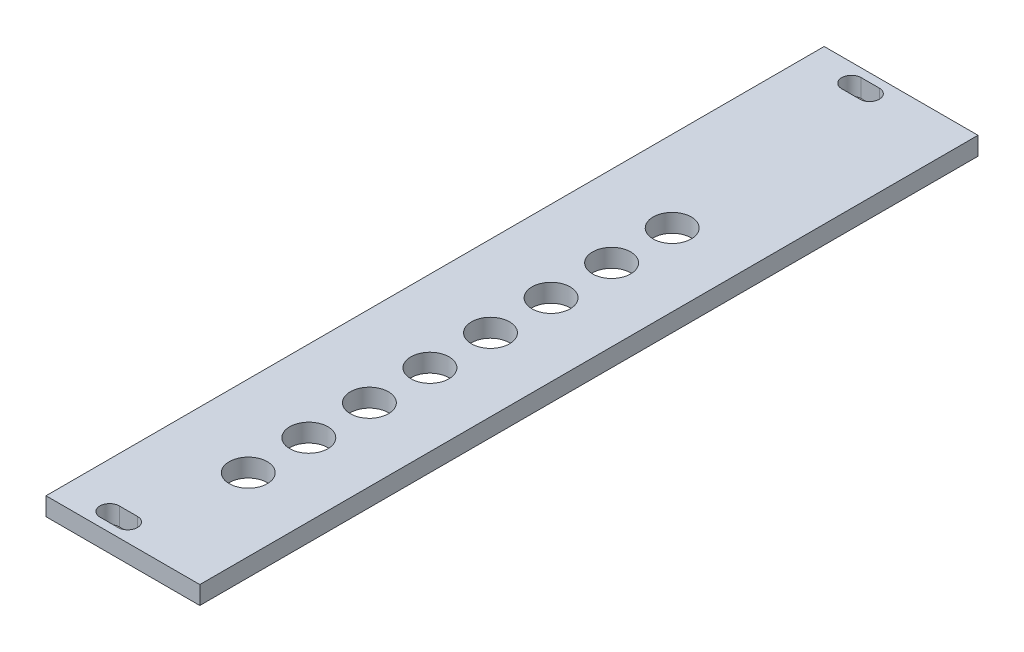
ISO-10303-21;
HEADER;
FILE_DESCRIPTION(('STEP AP214'),'2;1');
FILE_NAME('part.step','',(''),(''),'','','');
FILE_SCHEMA(('AUTOMOTIVE_DESIGN { 1 0 10303 214 1 1 1 1 }'));
ENDSEC;
DATA;
#1=APPLICATION_CONTEXT('core data for automotive mechanical design processes');
#2=APPLICATION_PROTOCOL_DEFINITION('international standard','automotive_design',2000,#1);
#3=PRODUCT_CONTEXT('',#1,'mechanical');
#4=PRODUCT('Part','Part','',(#3));
#5=PRODUCT_RELATED_PRODUCT_CATEGORY('part','',(#4));
#6=PRODUCT_DEFINITION_FORMATION('','',#4);
#7=PRODUCT_DEFINITION_CONTEXT('part definition',#1,'design');
#8=PRODUCT_DEFINITION('design','',#6,#7);
#9=PRODUCT_DEFINITION_SHAPE('','',#8);
#10=(LENGTH_UNIT() NAMED_UNIT(*) SI_UNIT(.MILLI.,.METRE.));
#11=(NAMED_UNIT(*) PLANE_ANGLE_UNIT() SI_UNIT($,.RADIAN.));
#12=(NAMED_UNIT(*) SI_UNIT($,.STERADIAN.) SOLID_ANGLE_UNIT());
#13=UNCERTAINTY_MEASURE_WITH_UNIT(LENGTH_MEASURE(1.E-05),#10,'distance_accuracy_value','');
#14=(GEOMETRIC_REPRESENTATION_CONTEXT(3) GLOBAL_UNCERTAINTY_ASSIGNED_CONTEXT((#13)) GLOBAL_UNIT_ASSIGNED_CONTEXT((#10,
#11,#12)) REPRESENTATION_CONTEXT('',''));
#15=CARTESIAN_POINT('',(0.,0.,0.));
#16=DIRECTION('',(0.,0.,1.));
#17=DIRECTION('',(1.,0.,0.));
#18=AXIS2_PLACEMENT_3D('',#15,#16,#17);
#19=CARTESIAN_POINT('',(0.,3.,0.));
#20=DIRECTION('',(0.,-1.,0.));
#21=DIRECTION('',(0.,0.,-1.));
#22=AXIS2_PLACEMENT_3D('',#19,#20,#21);
#23=PLANE('',#22);
#24=CARTESIAN_POINT('',(0.699999999999755,3.,-25.75));
#25=DIRECTION('',(0.,1.,0.));
#26=DIRECTION('',(0.,0.,1.));
#27=AXIS2_PLACEMENT_3D('',#24,#25,#26);
#28=CIRCLE('',#27,3.15);
#29=CARTESIAN_POINT('',(0.699999999999755,3.,-22.6));
#30=VERTEX_POINT('',#29);
#31=EDGE_CURVE('E334',#30,#30,#28,.T.);
#32=ORIENTED_EDGE('',*,*,#31,.F.);
#33=EDGE_LOOP('',(#32));
#34=FACE_BOUND('',#33,.T.);
#35=CARTESIAN_POINT('',(0.69999999999979,3.,-15.75));
#36=DIRECTION('',(0.,1.,0.));
#37=DIRECTION('',(0.,0.,1.));
#38=AXIS2_PLACEMENT_3D('',#35,#36,#37);
#39=CIRCLE('',#38,3.15);
#40=CARTESIAN_POINT('',(0.69999999999979,3.,-12.6));
#41=VERTEX_POINT('',#40);
#42=EDGE_CURVE('E342',#41,#41,#39,.T.);
#43=ORIENTED_EDGE('',*,*,#42,.F.);
#44=EDGE_LOOP('',(#43));
#45=FACE_BOUND('',#44,.T.);
#46=CARTESIAN_POINT('',(0.699999999999825,3.,-5.75000000000001));
#47=DIRECTION('',(0.,1.,0.));
#48=DIRECTION('',(0.,0.,1.));
#49=AXIS2_PLACEMENT_3D('',#46,#47,#48);
#50=CIRCLE('',#49,3.15);
#51=CARTESIAN_POINT('',(0.699999999999825,3.,-2.6));
#52=VERTEX_POINT('',#51);
#53=EDGE_CURVE('E348',#52,#52,#50,.T.);
#54=ORIENTED_EDGE('',*,*,#53,.F.);
#55=EDGE_LOOP('',(#54));
#56=FACE_BOUND('',#55,.T.);
#57=CARTESIAN_POINT('',(0.69999999999986,3.,4.25));
#58=DIRECTION('',(0.,1.,0.));
#59=DIRECTION('',(0.,0.,1.));
#60=AXIS2_PLACEMENT_3D('',#57,#58,#59);
#61=CIRCLE('',#60,3.15);
#62=CARTESIAN_POINT('',(0.69999999999986,3.,7.4));
#63=VERTEX_POINT('',#62);
#64=EDGE_CURVE('E354',#63,#63,#61,.T.);
#65=ORIENTED_EDGE('',*,*,#64,.F.);
#66=EDGE_LOOP('',(#65));
#67=FACE_BOUND('',#66,.T.);
#68=CARTESIAN_POINT('',(0.699999999999894,3.,14.25));
#69=DIRECTION('',(0.,1.,0.));
#70=DIRECTION('',(0.,0.,1.));
#71=AXIS2_PLACEMENT_3D('',#68,#69,#70);
#72=CIRCLE('',#71,3.15);
#73=CARTESIAN_POINT('',(0.699999999999894,3.,17.4));
#74=VERTEX_POINT('',#73);
#75=EDGE_CURVE('E360',#74,#74,#72,.T.);
#76=ORIENTED_EDGE('',*,*,#75,.F.);
#77=EDGE_LOOP('',(#76));
#78=FACE_BOUND('',#77,.T.);
#79=CARTESIAN_POINT('',(0.699999999999929,3.,24.25));
#80=DIRECTION('',(0.,1.,0.));
#81=DIRECTION('',(0.,0.,1.));
#82=AXIS2_PLACEMENT_3D('',#79,#80,#81);
#83=CIRCLE('',#82,3.15);
#84=CARTESIAN_POINT('',(0.699999999999929,3.,27.4));
#85=VERTEX_POINT('',#84);
#86=EDGE_CURVE('E366',#85,#85,#83,.T.);
#87=ORIENTED_EDGE('',*,*,#86,.F.);
#88=EDGE_LOOP('',(#87));
#89=FACE_BOUND('',#88,.T.);
#90=CARTESIAN_POINT('',(0.699999999999965,3.,34.25));
#91=DIRECTION('',(0.,1.,0.));
#92=DIRECTION('',(0.,0.,1.));
#93=AXIS2_PLACEMENT_3D('',#90,#91,#92);
#94=CIRCLE('',#93,3.15);
#95=CARTESIAN_POINT('',(0.699999999999965,3.,37.4));
#96=VERTEX_POINT('',#95);
#97=EDGE_CURVE('E372',#96,#96,#94,.T.);
#98=ORIENTED_EDGE('',*,*,#97,.F.);
#99=EDGE_LOOP('',(#98));
#100=FACE_BOUND('',#99,.T.);
#101=CARTESIAN_POINT('',(0.699999999999999,3.,44.25));
#102=DIRECTION('',(0.,1.,0.));
#103=DIRECTION('',(0.,0.,1.));
#104=AXIS2_PLACEMENT_3D('',#101,#102,#103);
#105=CIRCLE('',#104,3.15);
#106=CARTESIAN_POINT('',(0.699999999999999,3.,47.4));
#107=VERTEX_POINT('',#106);
#108=EDGE_CURVE('E151',#107,#107,#105,.T.);
#109=ORIENTED_EDGE('',*,*,#108,.F.);
#110=EDGE_LOOP('',(#109));
#111=FACE_BOUND('',#110,.T.);
#112=CARTESIAN_POINT('',(-5.2,3.,-61.25));
#113=DIRECTION('',(0.,1.,0.));
#114=DIRECTION('',(0.,0.,1.));
#115=AXIS2_PLACEMENT_3D('',#112,#113,#114);
#116=CIRCLE('',#115,1.6);
#117=CARTESIAN_POINT('',(-5.2,3.,-62.85));
#118=VERTEX_POINT('',#117);
#119=CARTESIAN_POINT('',(-5.2,3.,-59.65));
#120=VERTEX_POINT('',#119);
#121=EDGE_CURVE('E161',#118,#120,#116,.T.);
#122=ORIENTED_EDGE('',*,*,#121,.F.);
#123=DIRECTION('',(-1.,0.,0.));
#124=VECTOR('',#123,1.);
#125=CARTESIAN_POINT('',(-5.2,3.,-62.85));
#126=LINE('',#125,#124);
#127=CARTESIAN_POINT('',(-2.2,3.,-62.85));
#128=VERTEX_POINT('',#127);
#129=EDGE_CURVE('E169',#128,#118,#126,.T.);
#130=ORIENTED_EDGE('',*,*,#129,.F.);
#131=CARTESIAN_POINT('',(-2.2,3.,-61.25));
#132=DIRECTION('',(0.,1.,0.));
#133=DIRECTION('',(0.,0.,1.));
#134=AXIS2_PLACEMENT_3D('',#131,#132,#133);
#135=CIRCLE('',#134,1.6);
#136=CARTESIAN_POINT('',(-2.2,3.,-59.65));
#137=VERTEX_POINT('',#136);
#138=EDGE_CURVE('E166',#137,#128,#135,.T.);
#139=ORIENTED_EDGE('',*,*,#138,.F.);
#140=DIRECTION('',(1.,0.,0.));
#141=VECTOR('',#140,1.);
#142=CARTESIAN_POINT('',(-5.2,3.,-59.65));
#143=LINE('',#142,#141);
#144=EDGE_CURVE('E163',#120,#137,#143,.T.);
#145=ORIENTED_EDGE('',*,*,#144,.F.);
#146=EDGE_LOOP('',(#122,#130,#139,#145));
#147=FACE_BOUND('',#146,.T.);
#148=DIRECTION('',(0.,0.,-1.));
#149=VECTOR('',#148,1.);
#150=CARTESIAN_POINT('',(12.7,3.,64.25));
#151=LINE('',#150,#149);
#152=CARTESIAN_POINT('',(12.7,3.,64.25));
#153=VERTEX_POINT('',#152);
#154=CARTESIAN_POINT('',(12.7,3.,-64.25));
#155=VERTEX_POINT('',#154);
#156=EDGE_CURVE('E192',#153,#155,#151,.T.);
#157=ORIENTED_EDGE('',*,*,#156,.T.);
#158=DIRECTION('',(-1.,0.,0.));
#159=VECTOR('',#158,1.);
#160=CARTESIAN_POINT('',(-12.7,3.,-64.25));
#161=LINE('',#160,#159);
#162=CARTESIAN_POINT('',(-12.7,3.,-64.25));
#163=VERTEX_POINT('',#162);
#164=EDGE_CURVE('E195',#155,#163,#161,.T.);
#165=ORIENTED_EDGE('',*,*,#164,.T.);
#166=DIRECTION('',(0.,0.,1.));
#167=VECTOR('',#166,1.);
#168=CARTESIAN_POINT('',(-12.7,3.,64.25));
#169=LINE('',#168,#167);
#170=CARTESIAN_POINT('',(-12.7,3.,64.25));
#171=VERTEX_POINT('',#170);
#172=EDGE_CURVE('E198',#163,#171,#169,.T.);
#173=ORIENTED_EDGE('',*,*,#172,.T.);
#174=DIRECTION('',(1.,0.,0.));
#175=VECTOR('',#174,1.);
#176=CARTESIAN_POINT('',(-12.7,3.,64.25));
#177=LINE('',#176,#175);
#178=EDGE_CURVE('E200',#171,#153,#177,.T.);
#179=ORIENTED_EDGE('',*,*,#178,.T.);
#180=EDGE_LOOP('',(#157,#165,#173,#179));
#181=FACE_BOUND('',#180,.T.);
#182=CARTESIAN_POINT('',(-5.2,3.,61.25));
#183=DIRECTION('',(0.,1.,0.));
#184=DIRECTION('',(0.,0.,1.));
#185=AXIS2_PLACEMENT_3D('',#182,#183,#184);
#186=CIRCLE('',#185,1.59999999999999);
#187=CARTESIAN_POINT('',(-5.2,3.,59.65));
#188=VERTEX_POINT('',#187);
#189=CARTESIAN_POINT('',(-5.2,3.,62.85));
#190=VERTEX_POINT('',#189);
#191=EDGE_CURVE('E123',#188,#190,#186,.T.);
#192=ORIENTED_EDGE('',*,*,#191,.F.);
#193=DIRECTION('',(-1.,0.,0.));
#194=VECTOR('',#193,1.);
#195=CARTESIAN_POINT('',(-5.2,3.,59.65));
#196=LINE('',#195,#194);
#197=CARTESIAN_POINT('',(-2.2,3.,59.65));
#198=VERTEX_POINT('',#197);
#199=EDGE_CURVE('E145',#198,#188,#196,.T.);
#200=ORIENTED_EDGE('',*,*,#199,.F.);
#201=CARTESIAN_POINT('',(-2.2,3.,61.25));
#202=DIRECTION('',(0.,1.,0.));
#203=DIRECTION('',(0.,0.,1.));
#204=AXIS2_PLACEMENT_3D('',#201,#202,#203);
#205=CIRCLE('',#204,1.59999999999999);
#206=CARTESIAN_POINT('',(-2.2,3.,62.85));
#207=VERTEX_POINT('',#206);
#208=EDGE_CURVE('E143',#207,#198,#205,.T.);
#209=ORIENTED_EDGE('',*,*,#208,.F.);
#210=DIRECTION('',(1.,0.,0.));
#211=VECTOR('',#210,1.);
#212=CARTESIAN_POINT('',(-5.2,3.,62.85));
#213=LINE('',#212,#211);
#214=EDGE_CURVE('E131',#190,#207,#213,.T.);
#215=ORIENTED_EDGE('',*,*,#214,.F.);
#216=EDGE_LOOP('',(#192,#200,#209,#215));
#217=FACE_BOUND('',#216,.T.);
#218=ADVANCED_FACE('F34',(#34,#45,#56,#67,#78,#89,#100,#111,#147,#181,#217),#23,.F.);
#219=CARTESIAN_POINT('',(0.,0.,0.));
#220=DIRECTION('',(0.,-1.,0.));
#221=DIRECTION('',(0.,0.,-1.));
#222=AXIS2_PLACEMENT_3D('',#219,#220,#221);
#223=PLANE('',#222);
#224=CARTESIAN_POINT('',(0.699999999999755,0.,-25.75));
#225=DIRECTION('',(0.,1.,0.));
#226=DIRECTION('',(0.,0.,1.));
#227=AXIS2_PLACEMENT_3D('',#224,#225,#226);
#228=CIRCLE('',#227,3.15);
#229=CARTESIAN_POINT('',(0.699999999999755,0.,-22.6));
#230=VERTEX_POINT('',#229);
#231=EDGE_CURVE('E337',#230,#230,#228,.T.);
#232=ORIENTED_EDGE('',*,*,#231,.T.);
#233=EDGE_LOOP('',(#232));
#234=FACE_BOUND('',#233,.T.);
#235=CARTESIAN_POINT('',(0.69999999999979,0.,-15.75));
#236=DIRECTION('',(0.,1.,0.));
#237=DIRECTION('',(0.,0.,1.));
#238=AXIS2_PLACEMENT_3D('',#235,#236,#237);
#239=CIRCLE('',#238,3.15);
#240=CARTESIAN_POINT('',(0.69999999999979,0.,-12.6));
#241=VERTEX_POINT('',#240);
#242=EDGE_CURVE('E339',#241,#241,#239,.T.);
#243=ORIENTED_EDGE('',*,*,#242,.T.);
#244=EDGE_LOOP('',(#243));
#245=FACE_BOUND('',#244,.T.);
#246=CARTESIAN_POINT('',(0.699999999999825,0.,-5.75000000000001));
#247=DIRECTION('',(0.,1.,0.));
#248=DIRECTION('',(0.,0.,1.));
#249=AXIS2_PLACEMENT_3D('',#246,#247,#248);
#250=CIRCLE('',#249,3.15);
#251=CARTESIAN_POINT('',(0.699999999999825,0.,-2.6));
#252=VERTEX_POINT('',#251);
#253=EDGE_CURVE('E345',#252,#252,#250,.T.);
#254=ORIENTED_EDGE('',*,*,#253,.T.);
#255=EDGE_LOOP('',(#254));
#256=FACE_BOUND('',#255,.T.);
#257=CARTESIAN_POINT('',(0.69999999999986,0.,4.25));
#258=DIRECTION('',(0.,1.,0.));
#259=DIRECTION('',(0.,0.,1.));
#260=AXIS2_PLACEMENT_3D('',#257,#258,#259);
#261=CIRCLE('',#260,3.15);
#262=CARTESIAN_POINT('',(0.69999999999986,0.,7.4));
#263=VERTEX_POINT('',#262);
#264=EDGE_CURVE('E351',#263,#263,#261,.T.);
#265=ORIENTED_EDGE('',*,*,#264,.T.);
#266=EDGE_LOOP('',(#265));
#267=FACE_BOUND('',#266,.T.);
#268=CARTESIAN_POINT('',(0.699999999999894,0.,14.25));
#269=DIRECTION('',(0.,1.,0.));
#270=DIRECTION('',(0.,0.,1.));
#271=AXIS2_PLACEMENT_3D('',#268,#269,#270);
#272=CIRCLE('',#271,3.15);
#273=CARTESIAN_POINT('',(0.699999999999894,0.,17.4));
#274=VERTEX_POINT('',#273);
#275=EDGE_CURVE('E357',#274,#274,#272,.T.);
#276=ORIENTED_EDGE('',*,*,#275,.T.);
#277=EDGE_LOOP('',(#276));
#278=FACE_BOUND('',#277,.T.);
#279=CARTESIAN_POINT('',(0.699999999999929,0.,24.25));
#280=DIRECTION('',(0.,1.,0.));
#281=DIRECTION('',(0.,0.,1.));
#282=AXIS2_PLACEMENT_3D('',#279,#280,#281);
#283=CIRCLE('',#282,3.15);
#284=CARTESIAN_POINT('',(0.699999999999929,0.,27.4));
#285=VERTEX_POINT('',#284);
#286=EDGE_CURVE('E363',#285,#285,#283,.T.);
#287=ORIENTED_EDGE('',*,*,#286,.T.);
#288=EDGE_LOOP('',(#287));
#289=FACE_BOUND('',#288,.T.);
#290=CARTESIAN_POINT('',(0.699999999999965,0.,34.25));
#291=DIRECTION('',(0.,1.,0.));
#292=DIRECTION('',(0.,0.,1.));
#293=AXIS2_PLACEMENT_3D('',#290,#291,#292);
#294=CIRCLE('',#293,3.15);
#295=CARTESIAN_POINT('',(0.699999999999965,0.,37.4));
#296=VERTEX_POINT('',#295);
#297=EDGE_CURVE('E369',#296,#296,#294,.T.);
#298=ORIENTED_EDGE('',*,*,#297,.T.);
#299=EDGE_LOOP('',(#298));
#300=FACE_BOUND('',#299,.T.);
#301=CARTESIAN_POINT('',(0.699999999999999,0.,44.25));
#302=DIRECTION('',(0.,1.,0.));
#303=DIRECTION('',(0.,0.,1.));
#304=AXIS2_PLACEMENT_3D('',#301,#302,#303);
#305=CIRCLE('',#304,3.15);
#306=CARTESIAN_POINT('',(0.699999999999999,0.,47.4));
#307=VERTEX_POINT('',#306);
#308=EDGE_CURVE('E375',#307,#307,#305,.T.);
#309=ORIENTED_EDGE('',*,*,#308,.T.);
#310=EDGE_LOOP('',(#309));
#311=FACE_BOUND('',#310,.T.);
#312=DIRECTION('',(0.,0.,-1.));
#313=VECTOR('',#312,1.);
#314=CARTESIAN_POINT('',(12.7,0.,64.25));
#315=LINE('',#314,#313);
#316=CARTESIAN_POINT('',(12.7,0.,64.25));
#317=VERTEX_POINT('',#316);
#318=CARTESIAN_POINT('',(12.7,0.,-64.25));
#319=VERTEX_POINT('',#318);
#320=EDGE_CURVE('E191',#317,#319,#315,.T.);
#321=ORIENTED_EDGE('',*,*,#320,.F.);
#322=DIRECTION('',(1.,0.,0.));
#323=VECTOR('',#322,1.);
#324=CARTESIAN_POINT('',(-12.7,0.,64.25));
#325=LINE('',#324,#323);
#326=CARTESIAN_POINT('',(-12.7,0.,64.25));
#327=VERTEX_POINT('',#326);
#328=EDGE_CURVE('E196',#327,#317,#325,.T.);
#329=ORIENTED_EDGE('',*,*,#328,.F.);
#330=DIRECTION('',(0.,0.,1.));
#331=VECTOR('',#330,1.);
#332=CARTESIAN_POINT('',(-12.7,0.,64.25));
#333=LINE('',#332,#331);
#334=CARTESIAN_POINT('',(-12.7,0.,-64.25));
#335=VERTEX_POINT('',#334);
#336=EDGE_CURVE('E207',#335,#327,#333,.T.);
#337=ORIENTED_EDGE('',*,*,#336,.F.);
#338=DIRECTION('',(-1.,0.,0.));
#339=VECTOR('',#338,1.);
#340=CARTESIAN_POINT('',(-12.7,0.,-64.25));
#341=LINE('',#340,#339);
#342=EDGE_CURVE('E205',#319,#335,#341,.T.);
#343=ORIENTED_EDGE('',*,*,#342,.F.);
#344=EDGE_LOOP('',(#321,#329,#337,#343));
#345=FACE_BOUND('',#344,.T.);
#346=DIRECTION('',(-1.,0.,0.));
#347=VECTOR('',#346,1.);
#348=CARTESIAN_POINT('',(-5.2,0.,-62.85));
#349=LINE('',#348,#347);
#350=CARTESIAN_POINT('',(-2.2,0.,-62.85));
#351=VERTEX_POINT('',#350);
#352=CARTESIAN_POINT('',(-5.2,0.,-62.85));
#353=VERTEX_POINT('',#352);
#354=EDGE_CURVE('E164',#351,#353,#349,.T.);
#355=ORIENTED_EDGE('',*,*,#354,.T.);
#356=CARTESIAN_POINT('',(-5.2,0.,-61.25));
#357=DIRECTION('',(0.,1.,0.));
#358=DIRECTION('',(0.,0.,1.));
#359=AXIS2_PLACEMENT_3D('',#356,#357,#358);
#360=CIRCLE('',#359,1.6);
#361=CARTESIAN_POINT('',(-5.2,0.,-59.65));
#362=VERTEX_POINT('',#361);
#363=EDGE_CURVE('E139',#353,#362,#360,.T.);
#364=ORIENTED_EDGE('',*,*,#363,.T.);
#365=DIRECTION('',(1.,0.,0.));
#366=VECTOR('',#365,1.);
#367=CARTESIAN_POINT('',(-5.2,0.,-59.65));
#368=LINE('',#367,#366);
#369=CARTESIAN_POINT('',(-2.2,0.,-59.65));
#370=VERTEX_POINT('',#369);
#371=EDGE_CURVE('E174',#362,#370,#368,.T.);
#372=ORIENTED_EDGE('',*,*,#371,.T.);
#373=CARTESIAN_POINT('',(-2.2,0.,-61.25));
#374=DIRECTION('',(0.,1.,0.));
#375=DIRECTION('',(0.,0.,1.));
#376=AXIS2_PLACEMENT_3D('',#373,#374,#375);
#377=CIRCLE('',#376,1.6);
#378=EDGE_CURVE('E177',#370,#351,#377,.T.);
#379=ORIENTED_EDGE('',*,*,#378,.T.);
#380=EDGE_LOOP('',(#355,#364,#372,#379));
#381=FACE_BOUND('',#380,.T.);
#382=DIRECTION('',(-1.,0.,0.));
#383=VECTOR('',#382,1.);
#384=CARTESIAN_POINT('',(-5.2,0.,59.65));
#385=LINE('',#384,#383);
#386=CARTESIAN_POINT('',(-2.2,0.,59.65));
#387=VERTEX_POINT('',#386);
#388=CARTESIAN_POINT('',(-5.2,0.,59.65));
#389=VERTEX_POINT('',#388);
#390=EDGE_CURVE('E132',#387,#389,#385,.T.);
#391=ORIENTED_EDGE('',*,*,#390,.T.);
#392=CARTESIAN_POINT('',(-5.2,0.,61.25));
#393=DIRECTION('',(0.,1.,0.));
#394=DIRECTION('',(0.,0.,1.));
#395=AXIS2_PLACEMENT_3D('',#392,#393,#394);
#396=CIRCLE('',#395,1.59999999999999);
#397=CARTESIAN_POINT('',(-5.2,0.,62.85));
#398=VERTEX_POINT('',#397);
#399=EDGE_CURVE('E57',#389,#398,#396,.T.);
#400=ORIENTED_EDGE('',*,*,#399,.T.);
#401=DIRECTION('',(1.,0.,0.));
#402=VECTOR('',#401,1.);
#403=CARTESIAN_POINT('',(-5.2,0.,62.85));
#404=LINE('',#403,#402);
#405=CARTESIAN_POINT('',(-2.2,0.,62.85));
#406=VERTEX_POINT('',#405);
#407=EDGE_CURVE('E138',#398,#406,#404,.T.);
#408=ORIENTED_EDGE('',*,*,#407,.T.);
#409=CARTESIAN_POINT('',(-2.2,0.,61.25));
#410=DIRECTION('',(0.,1.,0.));
#411=DIRECTION('',(0.,0.,1.));
#412=AXIS2_PLACEMENT_3D('',#409,#410,#411);
#413=CIRCLE('',#412,1.59999999999999);
#414=EDGE_CURVE('E153',#406,#387,#413,.T.);
#415=ORIENTED_EDGE('',*,*,#414,.T.);
#416=EDGE_LOOP('',(#391,#400,#408,#415));
#417=FACE_BOUND('',#416,.T.);
#418=ADVANCED_FACE('F225',(#234,#245,#256,#267,#278,#289,#300,#311,#345,#381,#417),#223,.T.);
#419=CARTESIAN_POINT('',(12.7,3.,64.25));
#420=DIRECTION('',(-1.,0.,0.));
#421=DIRECTION('',(0.,0.,1.));
#422=AXIS2_PLACEMENT_3D('',#419,#420,#421);
#423=PLANE('',#422);
#424=ORIENTED_EDGE('',*,*,#320,.T.);
#425=DIRECTION('',(0.,-1.,0.));
#426=VECTOR('',#425,1.);
#427=CARTESIAN_POINT('',(12.7,3.,-64.25));
#428=LINE('',#427,#426);
#429=EDGE_CURVE('E11',#155,#319,#428,.T.);
#430=ORIENTED_EDGE('',*,*,#429,.F.);
#431=ORIENTED_EDGE('',*,*,#156,.F.);
#432=DIRECTION('',(0.,-1.,0.));
#433=VECTOR('',#432,1.);
#434=CARTESIAN_POINT('',(12.7,3.,64.25));
#435=LINE('',#434,#433);
#436=EDGE_CURVE('E202',#153,#317,#435,.T.);
#437=ORIENTED_EDGE('',*,*,#436,.T.);
#438=EDGE_LOOP('',(#424,#430,#431,#437));
#439=FACE_BOUND('',#438,.T.);
#440=ADVANCED_FACE('F36',(#439),#423,.F.);
#441=CARTESIAN_POINT('',(-12.7,3.,-64.25));
#442=DIRECTION('',(0.,0.,1.));
#443=DIRECTION('',(1.,0.,0.));
#444=AXIS2_PLACEMENT_3D('',#441,#442,#443);
#445=PLANE('',#444);
#446=ORIENTED_EDGE('',*,*,#342,.T.);
#447=DIRECTION('',(0.,-1.,0.));
#448=VECTOR('',#447,1.);
#449=CARTESIAN_POINT('',(-12.7,3.,-64.25));
#450=LINE('',#449,#448);
#451=EDGE_CURVE('E42',#163,#335,#450,.T.);
#452=ORIENTED_EDGE('',*,*,#451,.F.);
#453=ORIENTED_EDGE('',*,*,#164,.F.);
#454=ORIENTED_EDGE('',*,*,#429,.T.);
#455=EDGE_LOOP('',(#446,#452,#453,#454));
#456=FACE_BOUND('',#455,.T.);
#457=ADVANCED_FACE('F235',(#456),#445,.F.);
#458=CARTESIAN_POINT('',(-12.7,3.,64.25));
#459=DIRECTION('',(1.,0.,0.));
#460=DIRECTION('',(0.,0.,-1.));
#461=AXIS2_PLACEMENT_3D('',#458,#459,#460);
#462=PLANE('',#461);
#463=ORIENTED_EDGE('',*,*,#336,.T.);
#464=DIRECTION('',(0.,-1.,0.));
#465=VECTOR('',#464,1.);
#466=CARTESIAN_POINT('',(-12.7,3.,64.25));
#467=LINE('',#466,#465);
#468=EDGE_CURVE('E212',#171,#327,#467,.T.);
#469=ORIENTED_EDGE('',*,*,#468,.F.);
#470=ORIENTED_EDGE('',*,*,#172,.F.);
#471=ORIENTED_EDGE('',*,*,#451,.T.);
#472=EDGE_LOOP('',(#463,#469,#470,#471));
#473=FACE_BOUND('',#472,.T.);
#474=ADVANCED_FACE('F219',(#473),#462,.F.);
#475=CARTESIAN_POINT('',(-12.7,3.,64.25));
#476=DIRECTION('',(0.,0.,-1.));
#477=DIRECTION('',(-1.,0.,0.));
#478=AXIS2_PLACEMENT_3D('',#475,#476,#477);
#479=PLANE('',#478);
#480=ORIENTED_EDGE('',*,*,#328,.T.);
#481=ORIENTED_EDGE('',*,*,#436,.F.);
#482=ORIENTED_EDGE('',*,*,#178,.F.);
#483=ORIENTED_EDGE('',*,*,#468,.T.);
#484=EDGE_LOOP('',(#480,#481,#482,#483));
#485=FACE_BOUND('',#484,.T.);
#486=ADVANCED_FACE('F229',(#485),#479,.F.);
#487=CARTESIAN_POINT('',(-5.2,3.,-61.25));
#488=DIRECTION('',(0.,-1.,0.));
#489=DIRECTION('',(0.,0.,-1.));
#490=AXIS2_PLACEMENT_3D('',#487,#488,#489);
#491=CYLINDRICAL_SURFACE('',#490,1.6);
#492=ORIENTED_EDGE('',*,*,#363,.F.);
#493=DIRECTION('',(0.,-1.,0.));
#494=VECTOR('',#493,1.);
#495=CARTESIAN_POINT('',(-5.2,3.,-62.85));
#496=LINE('',#495,#494);
#497=EDGE_CURVE('E171',#118,#353,#496,.T.);
#498=ORIENTED_EDGE('',*,*,#497,.F.);
#499=ORIENTED_EDGE('',*,*,#121,.T.);
#500=DIRECTION('',(0.,-1.,0.));
#501=VECTOR('',#500,1.);
#502=CARTESIAN_POINT('',(-5.2,3.,-59.65));
#503=LINE('',#502,#501);
#504=EDGE_CURVE('E188',#120,#362,#503,.T.);
#505=ORIENTED_EDGE('',*,*,#504,.T.);
#506=EDGE_LOOP('',(#492,#498,#499,#505));
#507=FACE_BOUND('',#506,.T.);
#508=ADVANCED_FACE('F253',(#507),#491,.F.);
#509=CARTESIAN_POINT('',(-5.2,3.,-59.65));
#510=DIRECTION('',(0.,0.,-1.));
#511=DIRECTION('',(-1.,0.,0.));
#512=AXIS2_PLACEMENT_3D('',#509,#510,#511);
#513=PLANE('',#512);
#514=ORIENTED_EDGE('',*,*,#371,.F.);
#515=ORIENTED_EDGE('',*,*,#504,.F.);
#516=ORIENTED_EDGE('',*,*,#144,.T.);
#517=DIRECTION('',(0.,-1.,0.));
#518=VECTOR('',#517,1.);
#519=CARTESIAN_POINT('',(-2.2,3.,-59.65));
#520=LINE('',#519,#518);
#521=EDGE_CURVE('E186',#137,#370,#520,.T.);
#522=ORIENTED_EDGE('',*,*,#521,.T.);
#523=EDGE_LOOP('',(#514,#515,#516,#522));
#524=FACE_BOUND('',#523,.T.);
#525=ADVANCED_FACE('F260',(#524),#513,.T.);
#526=CARTESIAN_POINT('',(-2.2,3.,-61.25));
#527=DIRECTION('',(0.,-1.,0.));
#528=DIRECTION('',(0.,0.,-1.));
#529=AXIS2_PLACEMENT_3D('',#526,#527,#528);
#530=CYLINDRICAL_SURFACE('',#529,1.6);
#531=ORIENTED_EDGE('',*,*,#378,.F.);
#532=ORIENTED_EDGE('',*,*,#521,.F.);
#533=ORIENTED_EDGE('',*,*,#138,.T.);
#534=DIRECTION('',(0.,-1.,0.));
#535=VECTOR('',#534,1.);
#536=CARTESIAN_POINT('',(-2.2,3.,-62.85));
#537=LINE('',#536,#535);
#538=EDGE_CURVE('E184',#128,#351,#537,.T.);
#539=ORIENTED_EDGE('',*,*,#538,.T.);
#540=EDGE_LOOP('',(#531,#532,#533,#539));
#541=FACE_BOUND('',#540,.T.);
#542=ADVANCED_FACE('F265',(#541),#530,.F.);
#543=CARTESIAN_POINT('',(-5.2,3.,-62.85));
#544=DIRECTION('',(0.,0.,1.));
#545=DIRECTION('',(1.,0.,0.));
#546=AXIS2_PLACEMENT_3D('',#543,#544,#545);
#547=PLANE('',#546);
#548=ORIENTED_EDGE('',*,*,#354,.F.);
#549=ORIENTED_EDGE('',*,*,#538,.F.);
#550=ORIENTED_EDGE('',*,*,#129,.T.);
#551=ORIENTED_EDGE('',*,*,#497,.T.);
#552=EDGE_LOOP('',(#548,#549,#550,#551));
#553=FACE_BOUND('',#552,.T.);
#554=ADVANCED_FACE('F272',(#553),#547,.T.);
#555=CARTESIAN_POINT('',(-5.2,3.,61.25));
#556=DIRECTION('',(0.,-1.,0.));
#557=DIRECTION('',(0.,0.,-1.));
#558=AXIS2_PLACEMENT_3D('',#555,#556,#557);
#559=CYLINDRICAL_SURFACE('',#558,1.59999999999999);
#560=ORIENTED_EDGE('',*,*,#399,.F.);
#561=DIRECTION('',(0.,-1.,0.));
#562=VECTOR('',#561,1.);
#563=CARTESIAN_POINT('',(-5.2,3.,59.65));
#564=LINE('',#563,#562);
#565=EDGE_CURVE('E127',#188,#389,#564,.T.);
#566=ORIENTED_EDGE('',*,*,#565,.F.);
#567=ORIENTED_EDGE('',*,*,#191,.T.);
#568=DIRECTION('',(0.,-1.,0.));
#569=VECTOR('',#568,1.);
#570=CARTESIAN_POINT('',(-5.2,3.,62.85));
#571=LINE('',#570,#569);
#572=EDGE_CURVE('E126',#190,#398,#571,.T.);
#573=ORIENTED_EDGE('',*,*,#572,.T.);
#574=EDGE_LOOP('',(#560,#566,#567,#573));
#575=FACE_BOUND('',#574,.T.);
#576=ADVANCED_FACE('F125',(#575),#559,.F.);
#577=CARTESIAN_POINT('',(-5.2,3.,62.85));
#578=DIRECTION('',(0.,0.,-1.));
#579=DIRECTION('',(-1.,0.,0.));
#580=AXIS2_PLACEMENT_3D('',#577,#578,#579);
#581=PLANE('',#580);
#582=ORIENTED_EDGE('',*,*,#407,.F.);
#583=ORIENTED_EDGE('',*,*,#572,.F.);
#584=ORIENTED_EDGE('',*,*,#214,.T.);
#585=DIRECTION('',(0.,-1.,0.));
#586=VECTOR('',#585,1.);
#587=CARTESIAN_POINT('',(-2.2,3.,62.85));
#588=LINE('',#587,#586);
#589=EDGE_CURVE('E140',#207,#406,#588,.T.);
#590=ORIENTED_EDGE('',*,*,#589,.T.);
#591=EDGE_LOOP('',(#582,#583,#584,#590));
#592=FACE_BOUND('',#591,.T.);
#593=ADVANCED_FACE('F135',(#592),#581,.T.);
#594=CARTESIAN_POINT('',(-2.2,3.,61.25));
#595=DIRECTION('',(0.,-1.,0.));
#596=DIRECTION('',(0.,0.,-1.));
#597=AXIS2_PLACEMENT_3D('',#594,#595,#596);
#598=CYLINDRICAL_SURFACE('',#597,1.59999999999999);
#599=ORIENTED_EDGE('',*,*,#414,.F.);
#600=ORIENTED_EDGE('',*,*,#589,.F.);
#601=ORIENTED_EDGE('',*,*,#208,.T.);
#602=DIRECTION('',(0.,-1.,0.));
#603=VECTOR('',#602,1.);
#604=CARTESIAN_POINT('',(-2.2,3.,59.65));
#605=LINE('',#604,#603);
#606=EDGE_CURVE('E49',#198,#387,#605,.T.);
#607=ORIENTED_EDGE('',*,*,#606,.T.);
#608=EDGE_LOOP('',(#599,#600,#601,#607));
#609=FACE_BOUND('',#608,.T.);
#610=ADVANCED_FACE('F292',(#609),#598,.F.);
#611=CARTESIAN_POINT('',(-5.2,3.,59.65));
#612=DIRECTION('',(0.,0.,1.));
#613=DIRECTION('',(1.,0.,0.));
#614=AXIS2_PLACEMENT_3D('',#611,#612,#613);
#615=PLANE('',#614);
#616=ORIENTED_EDGE('',*,*,#390,.F.);
#617=ORIENTED_EDGE('',*,*,#606,.F.);
#618=ORIENTED_EDGE('',*,*,#199,.T.);
#619=ORIENTED_EDGE('',*,*,#565,.T.);
#620=EDGE_LOOP('',(#616,#617,#618,#619));
#621=FACE_BOUND('',#620,.T.);
#622=ADVANCED_FACE('F295',(#621),#615,.T.);
#623=CARTESIAN_POINT('',(0.699999999999999,3.,44.25));
#624=DIRECTION('',(0.,-1.,0.));
#625=DIRECTION('',(0.,0.,-1.));
#626=AXIS2_PLACEMENT_3D('',#623,#624,#625);
#627=CYLINDRICAL_SURFACE('',#626,3.15);
#628=ORIENTED_EDGE('',*,*,#108,.T.);
#629=EDGE_LOOP('',(#628));
#630=FACE_BOUND('',#629,.T.);
#631=ORIENTED_EDGE('',*,*,#308,.F.);
#632=EDGE_LOOP('',(#631));
#633=FACE_BOUND('',#632,.T.);
#634=ADVANCED_FACE('F299',(#630,#633),#627,.F.);
#635=CARTESIAN_POINT('',(0.699999999999965,3.,34.25));
#636=DIRECTION('',(0.,-1.,0.));
#637=DIRECTION('',(0.,0.,-1.));
#638=AXIS2_PLACEMENT_3D('',#635,#636,#637);
#639=CYLINDRICAL_SURFACE('',#638,3.15);
#640=ORIENTED_EDGE('',*,*,#97,.T.);
#641=EDGE_LOOP('',(#640));
#642=FACE_BOUND('',#641,.T.);
#643=ORIENTED_EDGE('',*,*,#297,.F.);
#644=EDGE_LOOP('',(#643));
#645=FACE_BOUND('',#644,.T.);
#646=ADVANCED_FACE('F302',(#642,#645),#639,.F.);
#647=CARTESIAN_POINT('',(0.699999999999929,3.,24.25));
#648=DIRECTION('',(0.,-1.,0.));
#649=DIRECTION('',(0.,0.,-1.));
#650=AXIS2_PLACEMENT_3D('',#647,#648,#649);
#651=CYLINDRICAL_SURFACE('',#650,3.15);
#652=ORIENTED_EDGE('',*,*,#86,.T.);
#653=EDGE_LOOP('',(#652));
#654=FACE_BOUND('',#653,.T.);
#655=ORIENTED_EDGE('',*,*,#286,.F.);
#656=EDGE_LOOP('',(#655));
#657=FACE_BOUND('',#656,.T.);
#658=ADVANCED_FACE('F306',(#654,#657),#651,.F.);
#659=CARTESIAN_POINT('',(0.699999999999894,3.,14.25));
#660=DIRECTION('',(0.,-1.,0.));
#661=DIRECTION('',(0.,0.,-1.));
#662=AXIS2_PLACEMENT_3D('',#659,#660,#661);
#663=CYLINDRICAL_SURFACE('',#662,3.15);
#664=ORIENTED_EDGE('',*,*,#75,.T.);
#665=EDGE_LOOP('',(#664));
#666=FACE_BOUND('',#665,.T.);
#667=ORIENTED_EDGE('',*,*,#275,.F.);
#668=EDGE_LOOP('',(#667));
#669=FACE_BOUND('',#668,.T.);
#670=ADVANCED_FACE('F310',(#666,#669),#663,.F.);
#671=CARTESIAN_POINT('',(0.69999999999986,3.,4.25));
#672=DIRECTION('',(0.,-1.,0.));
#673=DIRECTION('',(0.,0.,-1.));
#674=AXIS2_PLACEMENT_3D('',#671,#672,#673);
#675=CYLINDRICAL_SURFACE('',#674,3.15);
#676=ORIENTED_EDGE('',*,*,#64,.T.);
#677=EDGE_LOOP('',(#676));
#678=FACE_BOUND('',#677,.T.);
#679=ORIENTED_EDGE('',*,*,#264,.F.);
#680=EDGE_LOOP('',(#679));
#681=FACE_BOUND('',#680,.T.);
#682=ADVANCED_FACE('F314',(#678,#681),#675,.F.);
#683=CARTESIAN_POINT('',(0.699999999999825,3.,-5.75000000000001));
#684=DIRECTION('',(0.,-1.,0.));
#685=DIRECTION('',(0.,0.,-1.));
#686=AXIS2_PLACEMENT_3D('',#683,#684,#685);
#687=CYLINDRICAL_SURFACE('',#686,3.15);
#688=ORIENTED_EDGE('',*,*,#53,.T.);
#689=EDGE_LOOP('',(#688));
#690=FACE_BOUND('',#689,.T.);
#691=ORIENTED_EDGE('',*,*,#253,.F.);
#692=EDGE_LOOP('',(#691));
#693=FACE_BOUND('',#692,.T.);
#694=ADVANCED_FACE('F318',(#690,#693),#687,.F.);
#695=CARTESIAN_POINT('',(0.69999999999979,3.,-15.75));
#696=DIRECTION('',(0.,-1.,0.));
#697=DIRECTION('',(0.,0.,-1.));
#698=AXIS2_PLACEMENT_3D('',#695,#696,#697);
#699=CYLINDRICAL_SURFACE('',#698,3.15);
#700=ORIENTED_EDGE('',*,*,#42,.T.);
#701=EDGE_LOOP('',(#700));
#702=FACE_BOUND('',#701,.T.);
#703=ORIENTED_EDGE('',*,*,#242,.F.);
#704=EDGE_LOOP('',(#703));
#705=FACE_BOUND('',#704,.T.);
#706=ADVANCED_FACE('F322',(#702,#705),#699,.F.);
#707=CARTESIAN_POINT('',(0.699999999999755,3.,-25.75));
#708=DIRECTION('',(0.,-1.,0.));
#709=DIRECTION('',(0.,0.,-1.));
#710=AXIS2_PLACEMENT_3D('',#707,#708,#709);
#711=CYLINDRICAL_SURFACE('',#710,3.15);
#712=ORIENTED_EDGE('',*,*,#31,.T.);
#713=EDGE_LOOP('',(#712));
#714=FACE_BOUND('',#713,.T.);
#715=ORIENTED_EDGE('',*,*,#231,.F.);
#716=EDGE_LOOP('',(#715));
#717=FACE_BOUND('',#716,.T.);
#718=ADVANCED_FACE('F326',(#714,#717),#711,.F.);
#719=CLOSED_SHELL('',(#218,#418,#440,#457,#474,#486,#508,#525,#542,#554,#576,#593,#610,#622,
#634,#646,#658,#670,#682,#694,#706,#718));
#720=MANIFOLD_SOLID_BREP('B2',#719);
#721=ADVANCED_BREP_SHAPE_REPRESENTATION('',(#18,#720),#14);
#722=SHAPE_DEFINITION_REPRESENTATION(#9,#721);
ENDSEC;
END-ISO-10303-21;
